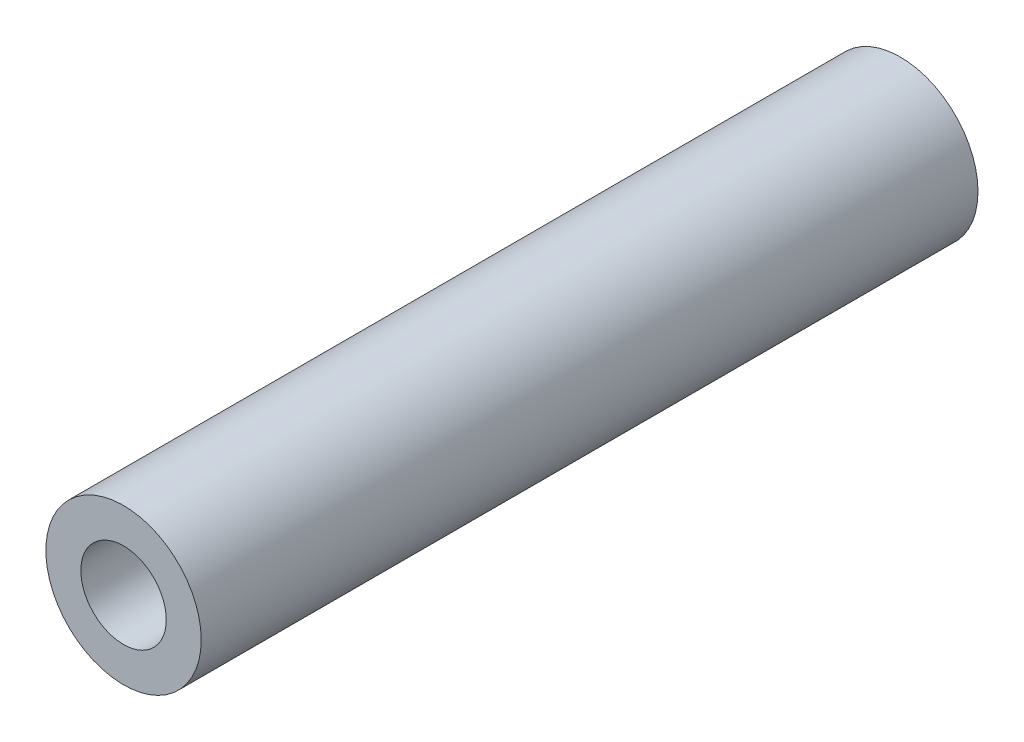
ISO-10303-21;
HEADER;
FILE_DESCRIPTION(('STEP AP214'),'2;1');
FILE_NAME('part.step','',(''),(''),'','','');
FILE_SCHEMA(('AUTOMOTIVE_DESIGN { 1 0 10303 214 1 1 1 1 }'));
ENDSEC;
DATA;
#1=APPLICATION_CONTEXT('core data for automotive mechanical design processes');
#2=APPLICATION_PROTOCOL_DEFINITION('international standard','automotive_design',2000,#1);
#3=PRODUCT_CONTEXT('',#1,'mechanical');
#4=PRODUCT('Part','Part','',(#3));
#5=PRODUCT_RELATED_PRODUCT_CATEGORY('part','',(#4));
#6=PRODUCT_DEFINITION_FORMATION('','',#4);
#7=PRODUCT_DEFINITION_CONTEXT('part definition',#1,'design');
#8=PRODUCT_DEFINITION('design','',#6,#7);
#9=PRODUCT_DEFINITION_SHAPE('','',#8);
#10=(LENGTH_UNIT() NAMED_UNIT(*) SI_UNIT(.MILLI.,.METRE.));
#11=(NAMED_UNIT(*) PLANE_ANGLE_UNIT() SI_UNIT($,.RADIAN.));
#12=(NAMED_UNIT(*) SI_UNIT($,.STERADIAN.) SOLID_ANGLE_UNIT());
#13=UNCERTAINTY_MEASURE_WITH_UNIT(LENGTH_MEASURE(1.E-05),#10,'distance_accuracy_value','');
#14=(GEOMETRIC_REPRESENTATION_CONTEXT(3) GLOBAL_UNCERTAINTY_ASSIGNED_CONTEXT((#13)) GLOBAL_UNIT_ASSIGNED_CONTEXT((#10,
#11,#12)) REPRESENTATION_CONTEXT('',''));
#15=CARTESIAN_POINT('',(0.,0.,0.));
#16=DIRECTION('',(0.,0.,1.));
#17=DIRECTION('',(1.,0.,0.));
#18=AXIS2_PLACEMENT_3D('',#15,#16,#17);
#19=CARTESIAN_POINT('',(0.,0.,15.));
#20=DIRECTION('',(0.,0.,-1.));
#21=DIRECTION('',(-1.,0.,0.));
#22=AXIS2_PLACEMENT_3D('',#19,#20,#21);
#23=CYLINDRICAL_SURFACE('',#22,3.);
#24=CARTESIAN_POINT('',(0.,0.,15.));
#25=DIRECTION('',(0.,0.,1.));
#26=DIRECTION('',(1.,0.,0.));
#27=AXIS2_PLACEMENT_3D('',#24,#25,#26);
#28=CIRCLE('',#27,3.);
#29=CARTESIAN_POINT('',(3.,0.,15.));
#30=VERTEX_POINT('',#29);
#31=EDGE_CURVE('E11',#30,#30,#28,.T.);
#32=ORIENTED_EDGE('',*,*,#31,.F.);
#33=EDGE_LOOP('',(#32));
#34=FACE_BOUND('',#33,.T.);
#35=CARTESIAN_POINT('',(0.,0.,-15.));
#36=DIRECTION('',(0.,0.,1.));
#37=DIRECTION('',(1.,0.,0.));
#38=AXIS2_PLACEMENT_3D('',#35,#36,#37);
#39=CIRCLE('',#38,3.);
#40=CARTESIAN_POINT('',(3.,0.,-15.));
#41=VERTEX_POINT('',#40);
#42=EDGE_CURVE('E38',#41,#41,#39,.T.);
#43=ORIENTED_EDGE('',*,*,#42,.T.);
#44=EDGE_LOOP('',(#43));
#45=FACE_BOUND('',#44,.T.);
#46=ADVANCED_FACE('F35',(#34,#45),#23,.T.);
#47=CARTESIAN_POINT('',(0.,0.,15.));
#48=DIRECTION('',(0.,0.,1.));
#49=DIRECTION('',(1.,0.,0.));
#50=AXIS2_PLACEMENT_3D('',#47,#48,#49);
#51=PLANE('',#50);
#52=CARTESIAN_POINT('',(0.,0.,15.));
#53=DIRECTION('',(0.,0.,1.));
#54=DIRECTION('',(1.,0.,0.));
#55=AXIS2_PLACEMENT_3D('',#52,#53,#54);
#56=CIRCLE('',#55,1.65);
#57=CARTESIAN_POINT('',(1.65,0.,15.));
#58=VERTEX_POINT('',#57);
#59=EDGE_CURVE('E59',#58,#58,#56,.T.);
#60=ORIENTED_EDGE('',*,*,#59,.F.);
#61=EDGE_LOOP('',(#60));
#62=FACE_BOUND('',#61,.T.);
#63=ORIENTED_EDGE('',*,*,#31,.T.);
#64=EDGE_LOOP('',(#63));
#65=FACE_BOUND('',#64,.T.);
#66=ADVANCED_FACE('F77',(#62,#65),#51,.T.);
#67=CARTESIAN_POINT('',(0.,0.,-15.));
#68=DIRECTION('',(0.,0.,1.));
#69=DIRECTION('',(1.,0.,0.));
#70=AXIS2_PLACEMENT_3D('',#67,#68,#69);
#71=PLANE('',#70);
#72=CARTESIAN_POINT('',(0.,0.,-15.));
#73=DIRECTION('',(0.,0.,-1.));
#74=DIRECTION('',(-1.,0.,0.));
#75=AXIS2_PLACEMENT_3D('',#72,#73,#74);
#76=CIRCLE('',#75,1.65);
#77=CARTESIAN_POINT('',(-1.65,0.,-15.));
#78=VERTEX_POINT('',#77);
#79=EDGE_CURVE('E58',#78,#78,#76,.T.);
#80=ORIENTED_EDGE('',*,*,#79,.F.);
#81=EDGE_LOOP('',(#80));
#82=FACE_BOUND('',#81,.T.);
#83=ORIENTED_EDGE('',*,*,#42,.F.);
#84=EDGE_LOOP('',(#83));
#85=FACE_BOUND('',#84,.T.);
#86=ADVANCED_FACE('F74',(#82,#85),#71,.F.);
#87=CARTESIAN_POINT('',(0.,0.,-6.5));
#88=DIRECTION('',(0.,0.,-1.));
#89=DIRECTION('',(-1.,0.,0.));
#90=AXIS2_PLACEMENT_3D('',#87,#88,#89);
#91=CONICAL_SURFACE('',#90,1.65,1.02974425867665);
#92=CARTESIAN_POINT('',(0.,0.,-5.50857997860452));
#93=VERTEX_POINT('',#92);
#94=VERTEX_LOOP('',#93);
#95=FACE_BOUND('',#94,.T.);
#96=CARTESIAN_POINT('',(0.,0.,-6.5));
#97=DIRECTION('',(0.,0.,-1.));
#98=DIRECTION('',(-1.,0.,0.));
#99=AXIS2_PLACEMENT_3D('',#96,#97,#98);
#100=CIRCLE('',#99,1.65);
#101=CARTESIAN_POINT('',(-1.65,0.,-6.5));
#102=VERTEX_POINT('',#101);
#103=EDGE_CURVE('E62',#102,#102,#100,.T.);
#104=ORIENTED_EDGE('',*,*,#103,.T.);
#105=EDGE_LOOP('',(#104));
#106=FACE_BOUND('',#105,.T.);
#107=ADVANCED_FACE('F76',(#95,#106),#91,.F.);
#108=CARTESIAN_POINT('',(0.,0.,-15.));
#109=DIRECTION('',(0.,0.,-1.));
#110=DIRECTION('',(-1.,0.,0.));
#111=AXIS2_PLACEMENT_3D('',#108,#109,#110);
#112=CYLINDRICAL_SURFACE('',#111,1.65);
#113=ORIENTED_EDGE('',*,*,#103,.F.);
#114=EDGE_LOOP('',(#113));
#115=FACE_BOUND('',#114,.T.);
#116=ORIENTED_EDGE('',*,*,#79,.T.);
#117=EDGE_LOOP('',(#116));
#118=FACE_BOUND('',#117,.T.);
#119=ADVANCED_FACE('F52',(#115,#118),#112,.F.);
#120=CARTESIAN_POINT('',(0.,0.,6.5));
#121=DIRECTION('',(0.,0.,1.));
#122=DIRECTION('',(1.,0.,0.));
#123=AXIS2_PLACEMENT_3D('',#120,#121,#122);
#124=CONICAL_SURFACE('',#123,1.65,1.02974425867665);
#125=CARTESIAN_POINT('',(0.,0.,5.50857997860452));
#126=VERTEX_POINT('',#125);
#127=VERTEX_LOOP('',#126);
#128=FACE_BOUND('',#127,.T.);
#129=CARTESIAN_POINT('',(0.,0.,6.5));
#130=DIRECTION('',(0.,0.,1.));
#131=DIRECTION('',(1.,0.,0.));
#132=AXIS2_PLACEMENT_3D('',#129,#130,#131);
#133=CIRCLE('',#132,1.65);
#134=CARTESIAN_POINT('',(1.65,0.,6.5));
#135=VERTEX_POINT('',#134);
#136=EDGE_CURVE('E56',#135,#135,#133,.T.);
#137=ORIENTED_EDGE('',*,*,#136,.T.);
#138=EDGE_LOOP('',(#137));
#139=FACE_BOUND('',#138,.T.);
#140=ADVANCED_FACE('F48',(#128,#139),#124,.F.);
#141=CARTESIAN_POINT('',(0.,0.,15.));
#142=DIRECTION('',(0.,0.,1.));
#143=DIRECTION('',(1.,0.,0.));
#144=AXIS2_PLACEMENT_3D('',#141,#142,#143);
#145=CYLINDRICAL_SURFACE('',#144,1.65);
#146=ORIENTED_EDGE('',*,*,#136,.F.);
#147=EDGE_LOOP('',(#146));
#148=FACE_BOUND('',#147,.T.);
#149=ORIENTED_EDGE('',*,*,#59,.T.);
#150=EDGE_LOOP('',(#149));
#151=FACE_BOUND('',#150,.T.);
#152=ADVANCED_FACE('F51',(#148,#151),#145,.F.);
#153=CLOSED_SHELL('',(#46,#66,#86,#107,#119,#140,#152));
#154=MANIFOLD_SOLID_BREP('B2',#153);
#155=ADVANCED_BREP_SHAPE_REPRESENTATION('',(#18,#154),#14);
#156=SHAPE_DEFINITION_REPRESENTATION(#9,#155);
ENDSEC;
END-ISO-10303-21;
